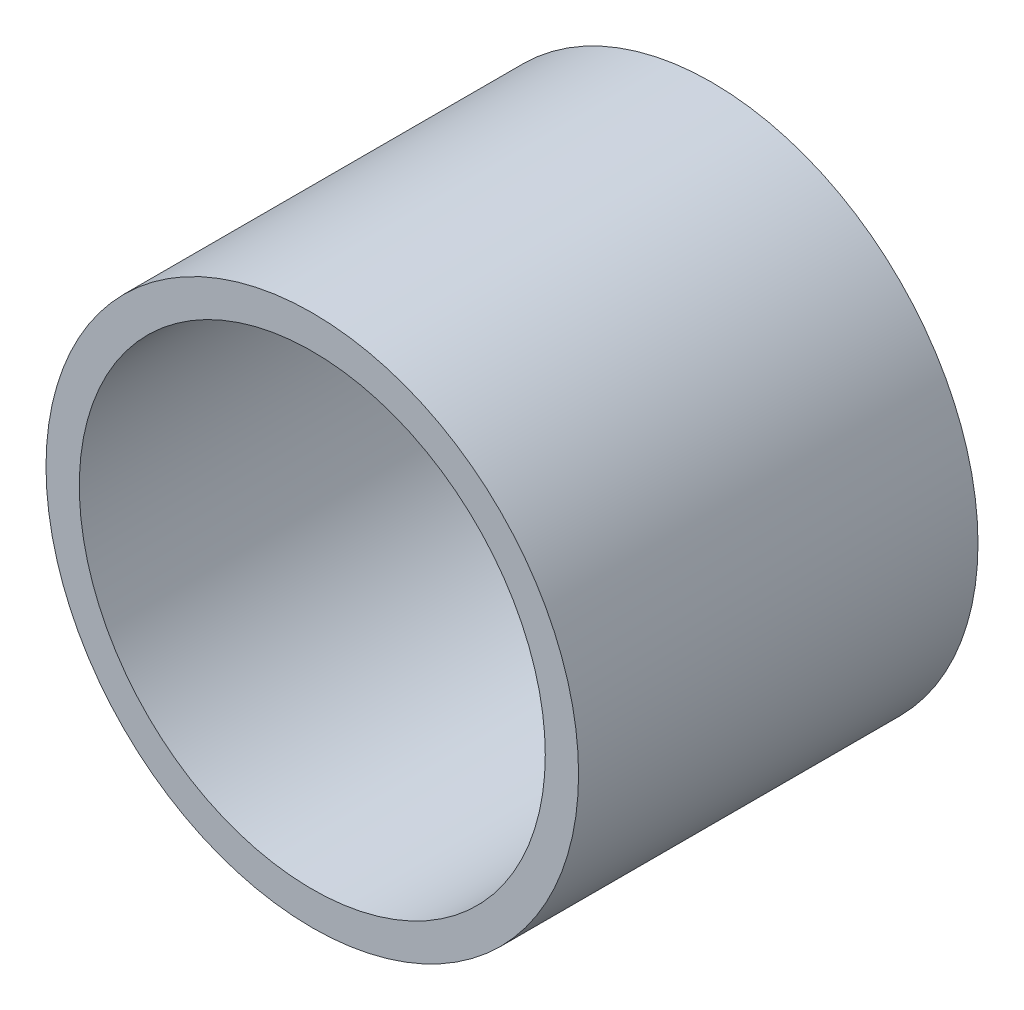
ISO-10303-21;
HEADER;
FILE_DESCRIPTION(('STEP AP214'),'2;1');
FILE_NAME('part.step','',(''),(''),'','','');
FILE_SCHEMA(('AUTOMOTIVE_DESIGN { 1 0 10303 214 1 1 1 1 }'));
ENDSEC;
DATA;
#1=APPLICATION_CONTEXT('core data for automotive mechanical design processes');
#2=APPLICATION_PROTOCOL_DEFINITION('international standard','automotive_design',2000,#1);
#3=PRODUCT_CONTEXT('',#1,'mechanical');
#4=PRODUCT('Part','Part','',(#3));
#5=PRODUCT_RELATED_PRODUCT_CATEGORY('part','',(#4));
#6=PRODUCT_DEFINITION_FORMATION('','',#4);
#7=PRODUCT_DEFINITION_CONTEXT('part definition',#1,'design');
#8=PRODUCT_DEFINITION('design','',#6,#7);
#9=PRODUCT_DEFINITION_SHAPE('','',#8);
#10=(LENGTH_UNIT() NAMED_UNIT(*) SI_UNIT(.MILLI.,.METRE.));
#11=(NAMED_UNIT(*) PLANE_ANGLE_UNIT() SI_UNIT($,.RADIAN.));
#12=(NAMED_UNIT(*) SI_UNIT($,.STERADIAN.) SOLID_ANGLE_UNIT());
#13=UNCERTAINTY_MEASURE_WITH_UNIT(LENGTH_MEASURE(1.E-05),#10,'distance_accuracy_value','');
#14=(GEOMETRIC_REPRESENTATION_CONTEXT(3) GLOBAL_UNCERTAINTY_ASSIGNED_CONTEXT((#13)) GLOBAL_UNIT_ASSIGNED_CONTEXT((#10,
#11,#12)) REPRESENTATION_CONTEXT('',''));
#15=CARTESIAN_POINT('',(0.,0.,0.));
#16=DIRECTION('',(0.,0.,1.));
#17=DIRECTION('',(1.,0.,0.));
#18=AXIS2_PLACEMENT_3D('',#15,#16,#17);
#19=CARTESIAN_POINT('',(0.,0.,6.));
#20=DIRECTION('',(0.,0.,1.));
#21=DIRECTION('',(1.,0.,0.));
#22=AXIS2_PLACEMENT_3D('',#19,#20,#21);
#23=PLANE('',#22);
#24=CARTESIAN_POINT('',(0.,0.,6.));
#25=DIRECTION('',(0.,0.,1.));
#26=DIRECTION('',(1.,0.,0.));
#27=AXIS2_PLACEMENT_3D('',#24,#25,#26);
#28=CIRCLE('',#27,4.);
#29=CARTESIAN_POINT('',(4.,0.,6.));
#30=VERTEX_POINT('',#29);
#31=EDGE_CURVE('E10',#30,#30,#28,.T.);
#32=ORIENTED_EDGE('',*,*,#31,.T.);
#33=EDGE_LOOP('',(#32));
#34=FACE_BOUND('',#33,.T.);
#35=CARTESIAN_POINT('',(0.,0.,6.));
#36=DIRECTION('',(0.,0.,1.));
#37=DIRECTION('',(1.,0.,0.));
#38=AXIS2_PLACEMENT_3D('',#35,#36,#37);
#39=CIRCLE('',#38,3.5);
#40=CARTESIAN_POINT('',(3.5,0.,6.));
#41=VERTEX_POINT('',#40);
#42=EDGE_CURVE('E48',#41,#41,#39,.T.);
#43=ORIENTED_EDGE('',*,*,#42,.F.);
#44=EDGE_LOOP('',(#43));
#45=FACE_BOUND('',#44,.T.);
#46=ADVANCED_FACE('F37',(#34,#45),#23,.T.);
#47=CARTESIAN_POINT('',(0.,0.,0.));
#48=DIRECTION('',(0.,0.,1.));
#49=DIRECTION('',(1.,0.,0.));
#50=AXIS2_PLACEMENT_3D('',#47,#48,#49);
#51=PLANE('',#50);
#52=CARTESIAN_POINT('',(0.,0.,0.));
#53=DIRECTION('',(0.,0.,1.));
#54=DIRECTION('',(1.,0.,0.));
#55=AXIS2_PLACEMENT_3D('',#52,#53,#54);
#56=CIRCLE('',#55,4.);
#57=CARTESIAN_POINT('',(4.,0.,0.));
#58=VERTEX_POINT('',#57);
#59=EDGE_CURVE('E41',#58,#58,#56,.T.);
#60=ORIENTED_EDGE('',*,*,#59,.F.);
#61=EDGE_LOOP('',(#60));
#62=FACE_BOUND('',#61,.T.);
#63=CARTESIAN_POINT('',(0.,0.,0.));
#64=DIRECTION('',(0.,0.,1.));
#65=DIRECTION('',(1.,0.,0.));
#66=AXIS2_PLACEMENT_3D('',#63,#64,#65);
#67=CIRCLE('',#66,3.5);
#68=CARTESIAN_POINT('',(3.5,0.,0.));
#69=VERTEX_POINT('',#68);
#70=EDGE_CURVE('E50',#69,#69,#67,.T.);
#71=ORIENTED_EDGE('',*,*,#70,.T.);
#72=EDGE_LOOP('',(#71));
#73=FACE_BOUND('',#72,.T.);
#74=ADVANCED_FACE('F60',(#62,#73),#51,.F.);
#75=CARTESIAN_POINT('',(0.,0.,6.));
#76=DIRECTION('',(0.,0.,-1.));
#77=DIRECTION('',(-1.,0.,0.));
#78=AXIS2_PLACEMENT_3D('',#75,#76,#77);
#79=CYLINDRICAL_SURFACE('',#78,4.);
#80=ORIENTED_EDGE('',*,*,#31,.F.);
#81=EDGE_LOOP('',(#80));
#82=FACE_BOUND('',#81,.T.);
#83=ORIENTED_EDGE('',*,*,#59,.T.);
#84=EDGE_LOOP('',(#83));
#85=FACE_BOUND('',#84,.T.);
#86=ADVANCED_FACE('F39',(#82,#85),#79,.T.);
#87=CARTESIAN_POINT('',(0.,0.,6.));
#88=DIRECTION('',(0.,0.,-1.));
#89=DIRECTION('',(-1.,0.,0.));
#90=AXIS2_PLACEMENT_3D('',#87,#88,#89);
#91=CYLINDRICAL_SURFACE('',#90,3.5);
#92=ORIENTED_EDGE('',*,*,#42,.T.);
#93=EDGE_LOOP('',(#92));
#94=FACE_BOUND('',#93,.T.);
#95=ORIENTED_EDGE('',*,*,#70,.F.);
#96=EDGE_LOOP('',(#95));
#97=FACE_BOUND('',#96,.T.);
#98=ADVANCED_FACE('F56',(#94,#97),#91,.F.);
#99=CLOSED_SHELL('',(#46,#74,#86,#98));
#100=MANIFOLD_SOLID_BREP('B2',#99);
#101=ADVANCED_BREP_SHAPE_REPRESENTATION('',(#18,#100),#14);
#102=SHAPE_DEFINITION_REPRESENTATION(#9,#101);
ENDSEC;
END-ISO-10303-21;
